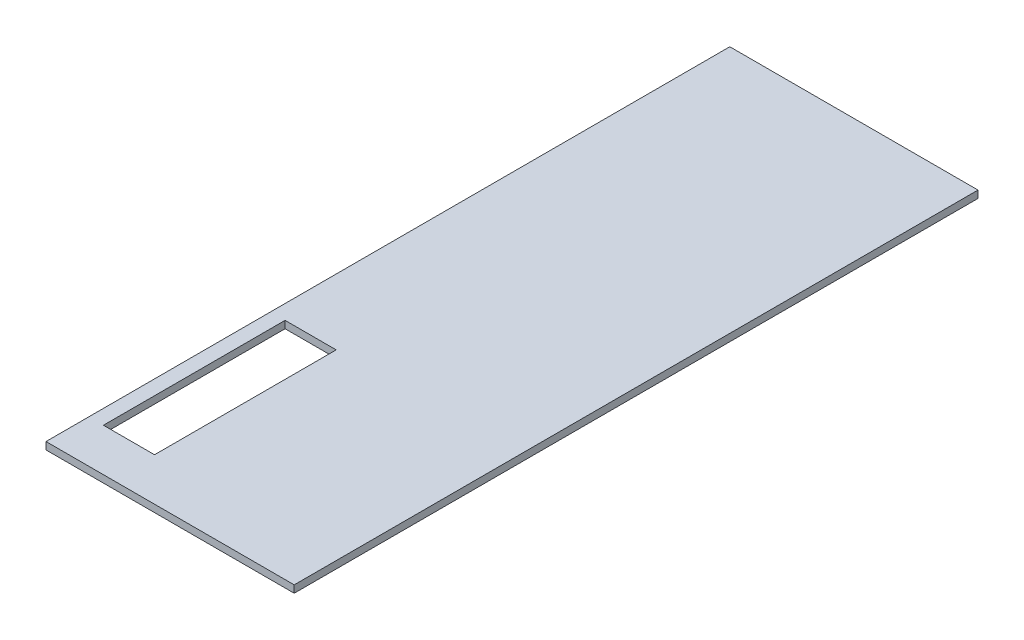
ISO-10303-21;
HEADER;
FILE_DESCRIPTION(('STEP AP214'),'2;1');
FILE_NAME('part.step','',(''),(''),'','','');
FILE_SCHEMA(('AUTOMOTIVE_DESIGN { 1 0 10303 214 1 1 1 1 }'));
ENDSEC;
DATA;
#1=APPLICATION_CONTEXT('core data for automotive mechanical design processes');
#2=APPLICATION_PROTOCOL_DEFINITION('international standard','automotive_design',2000,#1);
#3=PRODUCT_CONTEXT('',#1,'mechanical');
#4=PRODUCT('Part','Part','',(#3));
#5=PRODUCT_RELATED_PRODUCT_CATEGORY('part','',(#4));
#6=PRODUCT_DEFINITION_FORMATION('','',#4);
#7=PRODUCT_DEFINITION_CONTEXT('part definition',#1,'design');
#8=PRODUCT_DEFINITION('design','',#6,#7);
#9=PRODUCT_DEFINITION_SHAPE('','',#8);
#10=(LENGTH_UNIT() NAMED_UNIT(*) SI_UNIT(.MILLI.,.METRE.));
#11=(NAMED_UNIT(*) PLANE_ANGLE_UNIT() SI_UNIT($,.RADIAN.));
#12=(NAMED_UNIT(*) SI_UNIT($,.STERADIAN.) SOLID_ANGLE_UNIT());
#13=UNCERTAINTY_MEASURE_WITH_UNIT(LENGTH_MEASURE(1.E-05),#10,'distance_accuracy_value','');
#14=(GEOMETRIC_REPRESENTATION_CONTEXT(3) GLOBAL_UNCERTAINTY_ASSIGNED_CONTEXT((#13)) GLOBAL_UNIT_ASSIGNED_CONTEXT((#10,
#11,#12)) REPRESENTATION_CONTEXT('',''));
#15=CARTESIAN_POINT('',(0.,0.,0.));
#16=DIRECTION('',(0.,0.,1.));
#17=DIRECTION('',(1.,0.,0.));
#18=AXIS2_PLACEMENT_3D('',#15,#16,#17);
#19=CARTESIAN_POINT('',(2040.,-120.,5620.));
#20=DIRECTION('',(1.,0.,0.));
#21=DIRECTION('',(0.,0.,-1.));
#22=AXIS2_PLACEMENT_3D('',#19,#20,#21);
#23=PLANE('',#22);
#24=DIRECTION('',(0.,0.,-1.));
#25=VECTOR('',#24,1.);
#26=CARTESIAN_POINT('',(2040.,0.,5620.));
#27=LINE('',#26,#25);
#28=CARTESIAN_POINT('',(2040.,0.,5620.));
#29=VERTEX_POINT('',#28);
#30=CARTESIAN_POINT('',(2040.,0.,-5620.));
#31=VERTEX_POINT('',#30);
#32=EDGE_CURVE('E133',#29,#31,#27,.T.);
#33=ORIENTED_EDGE('',*,*,#32,.F.);
#34=DIRECTION('',(0.,1.,0.));
#35=VECTOR('',#34,1.);
#36=CARTESIAN_POINT('',(2040.,-120.,5620.));
#37=LINE('',#36,#35);
#38=CARTESIAN_POINT('',(2040.,-120.,5620.));
#39=VERTEX_POINT('',#38);
#40=EDGE_CURVE('E11',#39,#29,#37,.T.);
#41=ORIENTED_EDGE('',*,*,#40,.F.);
#42=DIRECTION('',(0.,0.,-1.));
#43=VECTOR('',#42,1.);
#44=CARTESIAN_POINT('',(2040.,-120.,5620.));
#45=LINE('',#44,#43);
#46=CARTESIAN_POINT('',(2040.,-120.,-5620.));
#47=VERTEX_POINT('',#46);
#48=EDGE_CURVE('E137',#39,#47,#45,.T.);
#49=ORIENTED_EDGE('',*,*,#48,.T.);
#50=DIRECTION('',(0.,1.,0.));
#51=VECTOR('',#50,1.);
#52=CARTESIAN_POINT('',(2040.,-120.,-5620.));
#53=LINE('',#52,#51);
#54=EDGE_CURVE('E38',#47,#31,#53,.T.);
#55=ORIENTED_EDGE('',*,*,#54,.T.);
#56=EDGE_LOOP('',(#33,#41,#49,#55));
#57=FACE_BOUND('',#56,.T.);
#58=ADVANCED_FACE('F35',(#57),#23,.T.);
#59=CARTESIAN_POINT('',(2040.,-120.,5620.));
#60=DIRECTION('',(0.,0.,1.));
#61=DIRECTION('',(1.,0.,0.));
#62=AXIS2_PLACEMENT_3D('',#59,#60,#61);
#63=PLANE('',#62);
#64=DIRECTION('',(1.,0.,0.));
#65=VECTOR('',#64,1.);
#66=CARTESIAN_POINT('',(2040.,0.,5620.));
#67=LINE('',#66,#65);
#68=CARTESIAN_POINT('',(-2040.,0.,5620.));
#69=VERTEX_POINT('',#68);
#70=EDGE_CURVE('E141',#69,#29,#67,.T.);
#71=ORIENTED_EDGE('',*,*,#70,.F.);
#72=DIRECTION('',(0.,1.,0.));
#73=VECTOR('',#72,1.);
#74=CARTESIAN_POINT('',(-2040.,-120.,5620.));
#75=LINE('',#74,#73);
#76=CARTESIAN_POINT('',(-2040.,-120.,5620.));
#77=VERTEX_POINT('',#76);
#78=EDGE_CURVE('E43',#77,#69,#75,.T.);
#79=ORIENTED_EDGE('',*,*,#78,.F.);
#80=DIRECTION('',(1.,0.,0.));
#81=VECTOR('',#80,1.);
#82=CARTESIAN_POINT('',(2040.,-120.,5620.));
#83=LINE('',#82,#81);
#84=EDGE_CURVE('E147',#77,#39,#83,.T.);
#85=ORIENTED_EDGE('',*,*,#84,.T.);
#86=ORIENTED_EDGE('',*,*,#40,.T.);
#87=EDGE_LOOP('',(#71,#79,#85,#86));
#88=FACE_BOUND('',#87,.T.);
#89=ADVANCED_FACE('F171',(#88),#63,.T.);
#90=CARTESIAN_POINT('',(-2040.,-120.,5620.));
#91=DIRECTION('',(-1.,0.,0.));
#92=DIRECTION('',(0.,0.,1.));
#93=AXIS2_PLACEMENT_3D('',#90,#91,#92);
#94=PLANE('',#93);
#95=DIRECTION('',(0.,0.,1.));
#96=VECTOR('',#95,1.);
#97=CARTESIAN_POINT('',(-2040.,0.,5620.));
#98=LINE('',#97,#96);
#99=CARTESIAN_POINT('',(-2040.,0.,-5620.));
#100=VERTEX_POINT('',#99);
#101=EDGE_CURVE('E155',#100,#69,#98,.T.);
#102=ORIENTED_EDGE('',*,*,#101,.F.);
#103=DIRECTION('',(0.,1.,0.));
#104=VECTOR('',#103,1.);
#105=CARTESIAN_POINT('',(-2040.,-120.,-5620.));
#106=LINE('',#105,#104);
#107=CARTESIAN_POINT('',(-2040.,-120.,-5620.));
#108=VERTEX_POINT('',#107);
#109=EDGE_CURVE('E160',#108,#100,#106,.T.);
#110=ORIENTED_EDGE('',*,*,#109,.F.);
#111=DIRECTION('',(0.,0.,1.));
#112=VECTOR('',#111,1.);
#113=CARTESIAN_POINT('',(-2040.,-120.,5620.));
#114=LINE('',#113,#112);
#115=EDGE_CURVE('E144',#108,#77,#114,.T.);
#116=ORIENTED_EDGE('',*,*,#115,.T.);
#117=ORIENTED_EDGE('',*,*,#78,.T.);
#118=EDGE_LOOP('',(#102,#110,#116,#117));
#119=FACE_BOUND('',#118,.T.);
#120=ADVANCED_FACE('F177',(#119),#94,.T.);
#121=CARTESIAN_POINT('',(2040.,-120.,-5620.));
#122=DIRECTION('',(0.,0.,-1.));
#123=DIRECTION('',(-1.,0.,0.));
#124=AXIS2_PLACEMENT_3D('',#121,#122,#123);
#125=PLANE('',#124);
#126=DIRECTION('',(-1.,0.,0.));
#127=VECTOR('',#126,1.);
#128=CARTESIAN_POINT('',(2040.,0.,-5620.));
#129=LINE('',#128,#127);
#130=EDGE_CURVE('E152',#31,#100,#129,.T.);
#131=ORIENTED_EDGE('',*,*,#130,.F.);
#132=ORIENTED_EDGE('',*,*,#54,.F.);
#133=DIRECTION('',(-1.,0.,0.));
#134=VECTOR('',#133,1.);
#135=CARTESIAN_POINT('',(2040.,-120.,-5620.));
#136=LINE('',#135,#134);
#137=EDGE_CURVE('E140',#47,#108,#136,.T.);
#138=ORIENTED_EDGE('',*,*,#137,.T.);
#139=ORIENTED_EDGE('',*,*,#109,.T.);
#140=EDGE_LOOP('',(#131,#132,#138,#139));
#141=FACE_BOUND('',#140,.T.);
#142=ADVANCED_FACE('F168',(#141),#125,.T.);
#143=CARTESIAN_POINT('',(0.,-120.,0.));
#144=DIRECTION('',(0.,1.,0.));
#145=DIRECTION('',(0.,0.,1.));
#146=AXIS2_PLACEMENT_3D('',#143,#144,#145);
#147=PLANE('',#146);
#148=DIRECTION('',(0.,0.,1.));
#149=VECTOR('',#148,1.);
#150=CARTESIAN_POINT('',(-960.,-120.,4915.86770424884));
#151=LINE('',#150,#149);
#152=CARTESIAN_POINT('',(-960.,-120.,1930.));
#153=VERTEX_POINT('',#152);
#154=CARTESIAN_POINT('',(-960.,-120.,4915.86770424884));
#155=VERTEX_POINT('',#154);
#156=EDGE_CURVE('E127',#153,#155,#151,.T.);
#157=ORIENTED_EDGE('',*,*,#156,.F.);
#158=DIRECTION('',(1.,0.,0.));
#159=VECTOR('',#158,1.);
#160=CARTESIAN_POINT('',(-960.,-120.,1930.));
#161=LINE('',#160,#159);
#162=CARTESIAN_POINT('',(-1800.,-120.,1930.));
#163=VERTEX_POINT('',#162);
#164=EDGE_CURVE('E51',#163,#153,#161,.T.);
#165=ORIENTED_EDGE('',*,*,#164,.F.);
#166=DIRECTION('',(0.,0.,-1.));
#167=VECTOR('',#166,1.);
#168=CARTESIAN_POINT('',(-1800.,-120.,1930.));
#169=LINE('',#168,#167);
#170=CARTESIAN_POINT('',(-1800.,-120.,4915.86770424884));
#171=VERTEX_POINT('',#170);
#172=EDGE_CURVE('E118',#171,#163,#169,.T.);
#173=ORIENTED_EDGE('',*,*,#172,.F.);
#174=DIRECTION('',(-1.,0.,0.));
#175=VECTOR('',#174,1.);
#176=CARTESIAN_POINT('',(-1800.,-120.,4915.86770424884));
#177=LINE('',#176,#175);
#178=EDGE_CURVE('E121',#155,#171,#177,.T.);
#179=ORIENTED_EDGE('',*,*,#178,.F.);
#180=EDGE_LOOP('',(#157,#165,#173,#179));
#181=FACE_BOUND('',#180,.T.);
#182=ORIENTED_EDGE('',*,*,#48,.F.);
#183=ORIENTED_EDGE('',*,*,#84,.F.);
#184=ORIENTED_EDGE('',*,*,#115,.F.);
#185=ORIENTED_EDGE('',*,*,#137,.F.);
#186=EDGE_LOOP('',(#182,#183,#184,#185));
#187=FACE_BOUND('',#186,.T.);
#188=ADVANCED_FACE('F174',(#181,#187),#147,.F.);
#189=CARTESIAN_POINT('',(0.,0.,0.));
#190=DIRECTION('',(0.,1.,0.));
#191=DIRECTION('',(0.,0.,1.));
#192=AXIS2_PLACEMENT_3D('',#189,#190,#191);
#193=PLANE('',#192);
#194=DIRECTION('',(1.,0.,0.));
#195=VECTOR('',#194,1.);
#196=CARTESIAN_POINT('',(-960.,0.,1930.));
#197=LINE('',#196,#195);
#198=CARTESIAN_POINT('',(-1800.,0.,1930.));
#199=VERTEX_POINT('',#198);
#200=CARTESIAN_POINT('',(-960.,0.,1930.));
#201=VERTEX_POINT('',#200);
#202=EDGE_CURVE('E102',#199,#201,#197,.T.);
#203=ORIENTED_EDGE('',*,*,#202,.T.);
#204=DIRECTION('',(0.,0.,1.));
#205=VECTOR('',#204,1.);
#206=CARTESIAN_POINT('',(-960.,0.,4915.86770424884));
#207=LINE('',#206,#205);
#208=CARTESIAN_POINT('',(-960.,0.,4915.86770424884));
#209=VERTEX_POINT('',#208);
#210=EDGE_CURVE('E111',#201,#209,#207,.T.);
#211=ORIENTED_EDGE('',*,*,#210,.T.);
#212=DIRECTION('',(-1.,0.,0.));
#213=VECTOR('',#212,1.);
#214=CARTESIAN_POINT('',(-1800.,0.,4915.86770424884));
#215=LINE('',#214,#213);
#216=CARTESIAN_POINT('',(-1800.,0.,4915.86770424884));
#217=VERTEX_POINT('',#216);
#218=EDGE_CURVE('E59',#209,#217,#215,.T.);
#219=ORIENTED_EDGE('',*,*,#218,.T.);
#220=DIRECTION('',(0.,0.,-1.));
#221=VECTOR('',#220,1.);
#222=CARTESIAN_POINT('',(-1800.,0.,1930.));
#223=LINE('',#222,#221);
#224=EDGE_CURVE('E108',#217,#199,#223,.T.);
#225=ORIENTED_EDGE('',*,*,#224,.T.);
#226=EDGE_LOOP('',(#203,#211,#219,#225));
#227=FACE_BOUND('',#226,.T.);
#228=ORIENTED_EDGE('',*,*,#32,.T.);
#229=ORIENTED_EDGE('',*,*,#130,.T.);
#230=ORIENTED_EDGE('',*,*,#101,.T.);
#231=ORIENTED_EDGE('',*,*,#70,.T.);
#232=EDGE_LOOP('',(#228,#229,#230,#231));
#233=FACE_BOUND('',#232,.T.);
#234=ADVANCED_FACE('F115',(#227,#233),#193,.T.);
#235=CARTESIAN_POINT('',(-960.,0.,1930.));
#236=DIRECTION('',(0.,0.,-1.));
#237=DIRECTION('',(-1.,0.,0.));
#238=AXIS2_PLACEMENT_3D('',#235,#236,#237);
#239=PLANE('',#238);
#240=ORIENTED_EDGE('',*,*,#164,.T.);
#241=DIRECTION('',(0.,-1.,0.));
#242=VECTOR('',#241,1.);
#243=CARTESIAN_POINT('',(-960.,0.,1930.));
#244=LINE('',#243,#242);
#245=EDGE_CURVE('E98',#201,#153,#244,.T.);
#246=ORIENTED_EDGE('',*,*,#245,.F.);
#247=ORIENTED_EDGE('',*,*,#202,.F.);
#248=DIRECTION('',(0.,-1.,0.));
#249=VECTOR('',#248,1.);
#250=CARTESIAN_POINT('',(-1800.,0.,1930.));
#251=LINE('',#250,#249);
#252=EDGE_CURVE('E131',#199,#163,#251,.T.);
#253=ORIENTED_EDGE('',*,*,#252,.T.);
#254=EDGE_LOOP('',(#240,#246,#247,#253));
#255=FACE_BOUND('',#254,.T.);
#256=ADVANCED_FACE('F100',(#255),#239,.F.);
#257=CARTESIAN_POINT('',(-1800.,0.,1930.));
#258=DIRECTION('',(-1.,0.,0.));
#259=DIRECTION('',(0.,0.,1.));
#260=AXIS2_PLACEMENT_3D('',#257,#258,#259);
#261=PLANE('',#260);
#262=ORIENTED_EDGE('',*,*,#172,.T.);
#263=ORIENTED_EDGE('',*,*,#252,.F.);
#264=ORIENTED_EDGE('',*,*,#224,.F.);
#265=DIRECTION('',(0.,-1.,0.));
#266=VECTOR('',#265,1.);
#267=CARTESIAN_POINT('',(-1800.,0.,4915.86770424884));
#268=LINE('',#267,#266);
#269=EDGE_CURVE('E134',#217,#171,#268,.T.);
#270=ORIENTED_EDGE('',*,*,#269,.T.);
#271=EDGE_LOOP('',(#262,#263,#264,#270));
#272=FACE_BOUND('',#271,.T.);
#273=ADVANCED_FACE('F224',(#272),#261,.F.);
#274=CARTESIAN_POINT('',(-1800.,0.,4915.86770424884));
#275=DIRECTION('',(0.,0.,1.));
#276=DIRECTION('',(1.,0.,0.));
#277=AXIS2_PLACEMENT_3D('',#274,#275,#276);
#278=PLANE('',#277);
#279=ORIENTED_EDGE('',*,*,#178,.T.);
#280=ORIENTED_EDGE('',*,*,#269,.F.);
#281=ORIENTED_EDGE('',*,*,#218,.F.);
#282=DIRECTION('',(0.,-1.,0.));
#283=VECTOR('',#282,1.);
#284=CARTESIAN_POINT('',(-960.,0.,4915.86770424884));
#285=LINE('',#284,#283);
#286=EDGE_CURVE('E107',#209,#155,#285,.T.);
#287=ORIENTED_EDGE('',*,*,#286,.T.);
#288=EDGE_LOOP('',(#279,#280,#281,#287));
#289=FACE_BOUND('',#288,.T.);
#290=ADVANCED_FACE('F233',(#289),#278,.F.);
#291=CARTESIAN_POINT('',(-960.,0.,4915.86770424884));
#292=DIRECTION('',(1.,0.,0.));
#293=DIRECTION('',(0.,0.,-1.));
#294=AXIS2_PLACEMENT_3D('',#291,#292,#293);
#295=PLANE('',#294);
#296=ORIENTED_EDGE('',*,*,#156,.T.);
#297=ORIENTED_EDGE('',*,*,#286,.F.);
#298=ORIENTED_EDGE('',*,*,#210,.F.);
#299=ORIENTED_EDGE('',*,*,#245,.T.);
#300=EDGE_LOOP('',(#296,#297,#298,#299));
#301=FACE_BOUND('',#300,.T.);
#302=ADVANCED_FACE('F112',(#301),#295,.F.);
#303=CLOSED_SHELL('',(#58,#89,#120,#142,#188,#234,#256,#273,#290,#302));
#304=MANIFOLD_SOLID_BREP('B2',#303);
#305=ADVANCED_BREP_SHAPE_REPRESENTATION('',(#18,#304),#14);
#306=SHAPE_DEFINITION_REPRESENTATION(#9,#305);
ENDSEC;
END-ISO-10303-21;
